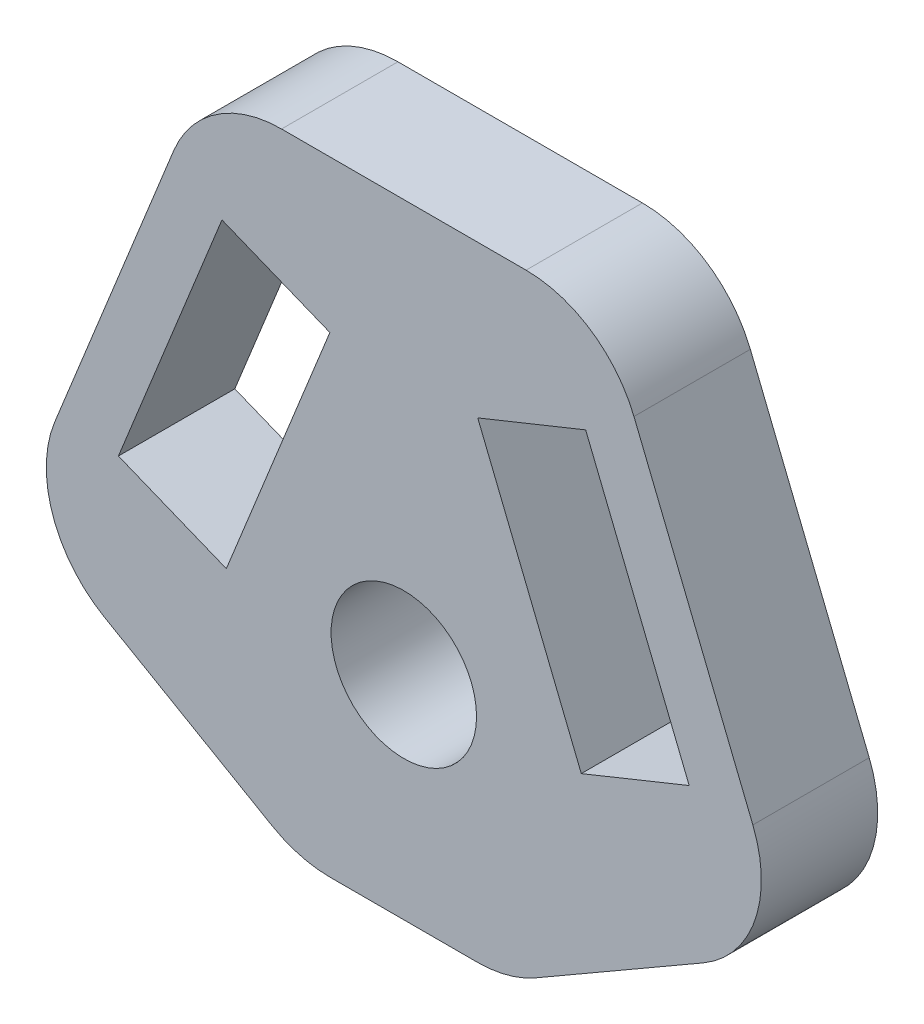
ISO-10303-21;
HEADER;
FILE_DESCRIPTION(('STEP AP214'),'2;1');
FILE_NAME('part.step','',(''),(''),'','','');
FILE_SCHEMA(('AUTOMOTIVE_DESIGN { 1 0 10303 214 1 1 1 1 }'));
ENDSEC;
DATA;
#1=APPLICATION_CONTEXT('core data for automotive mechanical design processes');
#2=APPLICATION_PROTOCOL_DEFINITION('international standard','automotive_design',2000,#1);
#3=PRODUCT_CONTEXT('',#1,'mechanical');
#4=PRODUCT('Part','Part','',(#3));
#5=PRODUCT_RELATED_PRODUCT_CATEGORY('part','',(#4));
#6=PRODUCT_DEFINITION_FORMATION('','',#4);
#7=PRODUCT_DEFINITION_CONTEXT('part definition',#1,'design');
#8=PRODUCT_DEFINITION('design','',#6,#7);
#9=PRODUCT_DEFINITION_SHAPE('','',#8);
#10=(LENGTH_UNIT() NAMED_UNIT(*) SI_UNIT(.MILLI.,.METRE.));
#11=(NAMED_UNIT(*) PLANE_ANGLE_UNIT() SI_UNIT($,.RADIAN.));
#12=(NAMED_UNIT(*) SI_UNIT($,.STERADIAN.) SOLID_ANGLE_UNIT());
#13=UNCERTAINTY_MEASURE_WITH_UNIT(LENGTH_MEASURE(1.E-05),#10,'distance_accuracy_value','');
#14=(GEOMETRIC_REPRESENTATION_CONTEXT(3) GLOBAL_UNCERTAINTY_ASSIGNED_CONTEXT((#13)) GLOBAL_UNIT_ASSIGNED_CONTEXT((#10,
#11,#12)) REPRESENTATION_CONTEXT('',''));
#15=CARTESIAN_POINT('',(0.,0.,0.));
#16=DIRECTION('',(0.,0.,1.));
#17=DIRECTION('',(1.,0.,0.));
#18=AXIS2_PLACEMENT_3D('',#15,#16,#17);
#19=CARTESIAN_POINT('',(0.,0.,4.));
#20=DIRECTION('',(0.,0.,-1.));
#21=DIRECTION('',(-1.,0.,0.));
#22=AXIS2_PLACEMENT_3D('',#19,#20,#21);
#23=PLANE('',#22);
#24=DIRECTION('',(0.927183854566789,0.374606593415907,0.));
#25=VECTOR('',#24,1.);
#26=CARTESIAN_POINT('',(9.80873541826716,1.60097289107058,4.));
#27=LINE('',#26,#25);
#28=CARTESIAN_POINT('',(6.1,0.102546517406955,4.));
#29=VERTEX_POINT('',#28);
#30=CARTESIAN_POINT('',(9.80873541826716,1.60097289107058,4.));
#31=VERTEX_POINT('',#30);
#32=EDGE_CURVE('E232',#29,#31,#27,.T.);
#33=ORIENTED_EDGE('',*,*,#32,.F.);
#34=DIRECTION('',(0.374606593415907,-0.92718385456679,0.));
#35=VECTOR('',#34,1.);
#36=CARTESIAN_POINT('',(6.1,0.102546517406955,4.));
#37=LINE('',#36,#35);
#38=CARTESIAN_POINT('',(2.54123736254889,8.91079313579145,4.));
#39=VERTEX_POINT('',#38);
#40=EDGE_CURVE('E243',#39,#29,#37,.T.);
#41=ORIENTED_EDGE('',*,*,#40,.F.);
#42=DIRECTION('',(-0.92718385456679,-0.374606593415907,0.));
#43=VECTOR('',#42,1.);
#44=CARTESIAN_POINT('',(2.54123736254889,8.91079313579145,4.));
#45=LINE('',#44,#43);
#46=CARTESIAN_POINT('',(6.24997278081605,10.4092195094551,4.));
#47=VERTEX_POINT('',#46);
#48=EDGE_CURVE('E239',#47,#39,#45,.T.);
#49=ORIENTED_EDGE('',*,*,#48,.F.);
#50=DIRECTION('',(-0.374606593415907,0.92718385456679,0.));
#51=VECTOR('',#50,1.);
#52=CARTESIAN_POINT('',(6.24997278081605,10.4092195094551,4.));
#53=LINE('',#52,#51);
#54=EDGE_CURVE('E235',#31,#47,#53,.T.);
#55=ORIENTED_EDGE('',*,*,#54,.F.);
#56=EDGE_LOOP('',(#33,#41,#49,#55));
#57=FACE_BOUND('',#56,.T.);
#58=DIRECTION('',(1.,0.,0.));
#59=VECTOR('',#58,1.);
#60=CARTESIAN_POINT('',(3.6,-7.3,4.));
#61=LINE('',#60,#59);
#62=CARTESIAN_POINT('',(-2.52820323027551,-7.3,4.));
#63=VERTEX_POINT('',#62);
#64=CARTESIAN_POINT('',(2.5282032302755,-7.3,4.));
#65=VERTEX_POINT('',#64);
#66=EDGE_CURVE('E298',#63,#65,#61,.T.);
#67=ORIENTED_EDGE('',*,*,#66,.T.);
#68=CARTESIAN_POINT('',(2.5282032302755,-3.3,4.));
#69=DIRECTION('',(0.,0.,-1.));
#70=DIRECTION('',(-1.,0.,0.));
#71=AXIS2_PLACEMENT_3D('',#68,#69,#70);
#72=CIRCLE('',#71,4.);
#73=CARTESIAN_POINT('',(4.52820323027551,-6.76410161513775,4.));
#74=VERTEX_POINT('',#73);
#75=EDGE_CURVE('E373',#65,#74,#72,.F.);
#76=ORIENTED_EDGE('',*,*,#75,.T.);
#77=DIRECTION('',(0.866025403784438,0.500000000000001,0.));
#78=VECTOR('',#77,1.);
#79=CARTESIAN_POINT('',(13.2994845223857,-1.69999999999999,4.));
#80=LINE('',#79,#78);
#81=CARTESIAN_POINT('',(10.2881869298987,-3.43857347563243,4.));
#82=VERTEX_POINT('',#81);
#83=EDGE_CURVE('E302',#74,#82,#80,.T.);
#84=ORIENTED_EDGE('',*,*,#83,.T.);
#85=CARTESIAN_POINT('',(8.28818692989871,0.0255281395053208,4.));
#86=DIRECTION('',(0.,0.,-1.));
#87=DIRECTION('',(-1.,0.,0.));
#88=AXIS2_PLACEMENT_3D('',#85,#86,#87);
#89=CIRCLE('',#88,4.);
#90=CARTESIAN_POINT('',(11.9969223481659,1.52395451316895,4.));
#91=VERTEX_POINT('',#90);
#92=EDGE_CURVE('E365',#82,#91,#89,.F.);
#93=ORIENTED_EDGE('',*,*,#92,.T.);
#94=DIRECTION('',(-0.374606593415906,0.92718385456679,0.));
#95=VECTOR('',#94,1.);
#96=CARTESIAN_POINT('',(6.9,14.1392800099982,4.));
#97=LINE('',#96,#95);
#98=CARTESIAN_POINT('',(7.91070135089744,11.6377063836618,4.));
#99=VERTEX_POINT('',#98);
#100=EDGE_CURVE('E283',#91,#99,#97,.T.);
#101=ORIENTED_EDGE('',*,*,#100,.T.);
#102=CARTESIAN_POINT('',(4.20196593263028,10.1392800099982,4.));
#103=DIRECTION('',(0.,0.,-1.));
#104=DIRECTION('',(-1.,0.,0.));
#105=AXIS2_PLACEMENT_3D('',#102,#103,#104);
#106=CIRCLE('',#105,4.);
#107=CARTESIAN_POINT('',(4.20196593263027,14.1392800099982,4.));
#108=VERTEX_POINT('',#107);
#109=EDGE_CURVE('E359',#99,#108,#106,.F.);
#110=ORIENTED_EDGE('',*,*,#109,.T.);
#111=DIRECTION('',(-1.,0.,0.));
#112=VECTOR('',#111,1.);
#113=CARTESIAN_POINT('',(-6.9,14.1392800099982,4.));
#114=LINE('',#113,#112);
#115=CARTESIAN_POINT('',(-4.20196593263028,14.1392800099982,4.));
#116=VERTEX_POINT('',#115);
#117=EDGE_CURVE('E287',#108,#116,#114,.T.);
#118=ORIENTED_EDGE('',*,*,#117,.T.);
#119=CARTESIAN_POINT('',(-4.20196593263028,10.1392800099982,4.));
#120=DIRECTION('',(0.,0.,-1.));
#121=DIRECTION('',(-1.,0.,0.));
#122=AXIS2_PLACEMENT_3D('',#119,#120,#121);
#123=CIRCLE('',#122,4.);
#124=CARTESIAN_POINT('',(-7.91070135089744,11.6377063836618,4.));
#125=VERTEX_POINT('',#124);
#126=EDGE_CURVE('E362',#116,#125,#123,.F.);
#127=ORIENTED_EDGE('',*,*,#126,.T.);
#128=DIRECTION('',(-0.374606593415907,-0.92718385456679,0.));
#129=VECTOR('',#128,1.);
#130=CARTESIAN_POINT('',(-6.9,14.1392800099982,4.));
#131=LINE('',#130,#129);
#132=CARTESIAN_POINT('',(-11.9969223481659,1.52395451316895,4.));
#133=VERTEX_POINT('',#132);
#134=EDGE_CURVE('E292',#125,#133,#131,.T.);
#135=ORIENTED_EDGE('',*,*,#134,.T.);
#136=CARTESIAN_POINT('',(-8.28818692989871,0.0255281395053228,4.));
#137=DIRECTION('',(0.,0.,-1.));
#138=DIRECTION('',(-1.,0.,0.));
#139=AXIS2_PLACEMENT_3D('',#136,#137,#138);
#140=CIRCLE('',#139,4.);
#141=CARTESIAN_POINT('',(-10.2881869298987,-3.43857347563243,4.));
#142=VERTEX_POINT('',#141);
#143=EDGE_CURVE('E62',#133,#142,#140,.F.);
#144=ORIENTED_EDGE('',*,*,#143,.T.);
#145=DIRECTION('',(0.866025403784438,-0.500000000000001,0.));
#146=VECTOR('',#145,1.);
#147=CARTESIAN_POINT('',(-13.2994845223857,-1.69999999999999,4.));
#148=LINE('',#147,#146);
#149=CARTESIAN_POINT('',(-4.52820323027551,-6.76410161513775,4.));
#150=VERTEX_POINT('',#149);
#151=EDGE_CURVE('E295',#142,#150,#148,.T.);
#152=ORIENTED_EDGE('',*,*,#151,.T.);
#153=CARTESIAN_POINT('',(-2.5282032302755,-3.3,4.));
#154=DIRECTION('',(0.,0.,-1.));
#155=DIRECTION('',(-1.,0.,0.));
#156=AXIS2_PLACEMENT_3D('',#153,#154,#155);
#157=CIRCLE('',#156,4.);
#158=EDGE_CURVE('E370',#150,#63,#157,.F.);
#159=ORIENTED_EDGE('',*,*,#158,.T.);
#160=EDGE_LOOP('',(#67,#76,#84,#93,#101,#110,#118,#127,#135,#144,#152,#159));
#161=FACE_BOUND('',#160,.T.);
#162=CARTESIAN_POINT('',(0.,0.,4.));
#163=DIRECTION('',(0.,0.,1.));
#164=DIRECTION('',(1.,0.,0.));
#165=AXIS2_PLACEMENT_3D('',#162,#163,#164);
#166=CIRCLE('',#165,2.5);
#167=CARTESIAN_POINT('',(2.5,0.,4.));
#168=VERTEX_POINT('',#167);
#169=EDGE_CURVE('E275',#168,#168,#166,.T.);
#170=ORIENTED_EDGE('',*,*,#169,.F.);
#171=EDGE_LOOP('',(#170));
#172=FACE_BOUND('',#171,.T.);
#173=DIRECTION('',(0.92718385456679,-0.374606593415907,0.));
#174=VECTOR('',#173,1.);
#175=CARTESIAN_POINT('',(-9.80873541826716,1.60097289107058,4.));
#176=LINE('',#175,#174);
#177=CARTESIAN_POINT('',(-9.80873541826716,1.60097289107058,4.));
#178=VERTEX_POINT('',#177);
#179=CARTESIAN_POINT('',(-6.1,0.102546517406955,4.));
#180=VERTEX_POINT('',#179);
#181=EDGE_CURVE('E179',#178,#180,#176,.T.);
#182=ORIENTED_EDGE('',*,*,#181,.F.);
#183=DIRECTION('',(-0.374606593415907,-0.927183854566789,0.));
#184=VECTOR('',#183,1.);
#185=CARTESIAN_POINT('',(-6.24997278081605,10.4092195094551,4.));
#186=LINE('',#185,#184);
#187=CARTESIAN_POINT('',(-6.24997278081605,10.4092195094551,4.));
#188=VERTEX_POINT('',#187);
#189=EDGE_CURVE('E208',#188,#178,#186,.T.);
#190=ORIENTED_EDGE('',*,*,#189,.F.);
#191=DIRECTION('',(-0.92718385456679,0.374606593415907,0.));
#192=VECTOR('',#191,1.);
#193=CARTESIAN_POINT('',(-2.54123736254889,8.91079313579145,4.));
#194=LINE('',#193,#192);
#195=CARTESIAN_POINT('',(-2.54123736254889,8.91079313579145,4.));
#196=VERTEX_POINT('',#195);
#197=EDGE_CURVE('E204',#196,#188,#194,.T.);
#198=ORIENTED_EDGE('',*,*,#197,.F.);
#199=DIRECTION('',(0.374606593415907,0.927183854566789,0.));
#200=VECTOR('',#199,1.);
#201=CARTESIAN_POINT('',(-6.1,0.102546517406955,4.));
#202=LINE('',#201,#200);
#203=EDGE_CURVE('E190',#180,#196,#202,.T.);
#204=ORIENTED_EDGE('',*,*,#203,.F.);
#205=EDGE_LOOP('',(#182,#190,#198,#204));
#206=FACE_BOUND('',#205,.T.);
#207=ADVANCED_FACE('F39',(#57,#161,#172,#206),#23,.F.);
#208=CARTESIAN_POINT('',(0.,0.,0.));
#209=DIRECTION('',(0.,0.,-1.));
#210=DIRECTION('',(-1.,0.,0.));
#211=AXIS2_PLACEMENT_3D('',#208,#209,#210);
#212=PLANE('',#211);
#213=DIRECTION('',(0.866025403784438,0.500000000000001,0.));
#214=VECTOR('',#213,1.);
#215=CARTESIAN_POINT('',(13.2994845223857,-1.69999999999999,0.));
#216=LINE('',#215,#214);
#217=CARTESIAN_POINT('',(4.52820323027551,-6.76410161513775,0.));
#218=VERTEX_POINT('',#217);
#219=CARTESIAN_POINT('',(10.2881869298987,-3.43857347563243,0.));
#220=VERTEX_POINT('',#219);
#221=EDGE_CURVE('E288',#218,#220,#216,.T.);
#222=ORIENTED_EDGE('',*,*,#221,.F.);
#223=CARTESIAN_POINT('',(2.5282032302755,-3.3,0.));
#224=DIRECTION('',(0.,0.,-1.));
#225=DIRECTION('',(-1.,0.,0.));
#226=AXIS2_PLACEMENT_3D('',#223,#224,#225);
#227=CIRCLE('',#226,4.);
#228=CARTESIAN_POINT('',(2.5282032302755,-7.3,0.));
#229=VERTEX_POINT('',#228);
#230=EDGE_CURVE('E349',#218,#229,#227,.T.);
#231=ORIENTED_EDGE('',*,*,#230,.T.);
#232=DIRECTION('',(1.,0.,0.));
#233=VECTOR('',#232,1.);
#234=CARTESIAN_POINT('',(3.6,-7.3,0.));
#235=LINE('',#234,#233);
#236=CARTESIAN_POINT('',(-2.52820323027551,-7.3,0.));
#237=VERTEX_POINT('',#236);
#238=EDGE_CURVE('E321',#237,#229,#235,.T.);
#239=ORIENTED_EDGE('',*,*,#238,.F.);
#240=CARTESIAN_POINT('',(-2.5282032302755,-3.3,0.));
#241=DIRECTION('',(0.,0.,-1.));
#242=DIRECTION('',(-1.,0.,0.));
#243=AXIS2_PLACEMENT_3D('',#240,#241,#242);
#244=CIRCLE('',#243,4.);
#245=CARTESIAN_POINT('',(-4.52820323027551,-6.76410161513775,0.));
#246=VERTEX_POINT('',#245);
#247=EDGE_CURVE('E346',#237,#246,#244,.T.);
#248=ORIENTED_EDGE('',*,*,#247,.T.);
#249=DIRECTION('',(0.866025403784438,-0.500000000000001,0.));
#250=VECTOR('',#249,1.);
#251=CARTESIAN_POINT('',(-13.2994845223857,-1.69999999999999,0.));
#252=LINE('',#251,#250);
#253=CARTESIAN_POINT('',(-10.2881869298987,-3.43857347563243,0.));
#254=VERTEX_POINT('',#253);
#255=EDGE_CURVE('E318',#254,#246,#252,.T.);
#256=ORIENTED_EDGE('',*,*,#255,.F.);
#257=CARTESIAN_POINT('',(-8.28818692989871,0.0255281395053228,0.));
#258=DIRECTION('',(0.,0.,-1.));
#259=DIRECTION('',(-1.,0.,0.));
#260=AXIS2_PLACEMENT_3D('',#257,#258,#259);
#261=CIRCLE('',#260,4.);
#262=CARTESIAN_POINT('',(-11.9969223481659,1.52395451316895,0.));
#263=VERTEX_POINT('',#262);
#264=EDGE_CURVE('E343',#254,#263,#261,.T.);
#265=ORIENTED_EDGE('',*,*,#264,.T.);
#266=DIRECTION('',(-0.374606593415907,-0.92718385456679,0.));
#267=VECTOR('',#266,1.);
#268=CARTESIAN_POINT('',(-6.9,14.1392800099982,0.));
#269=LINE('',#268,#267);
#270=CARTESIAN_POINT('',(-7.91070135089744,11.6377063836618,0.));
#271=VERTEX_POINT('',#270);
#272=EDGE_CURVE('E314',#271,#263,#269,.T.);
#273=ORIENTED_EDGE('',*,*,#272,.F.);
#274=CARTESIAN_POINT('',(-4.20196593263028,10.1392800099982,0.));
#275=DIRECTION('',(0.,0.,-1.));
#276=DIRECTION('',(-1.,0.,0.));
#277=AXIS2_PLACEMENT_3D('',#274,#275,#276);
#278=CIRCLE('',#277,4.);
#279=CARTESIAN_POINT('',(-4.20196593263028,14.1392800099982,0.));
#280=VERTEX_POINT('',#279);
#281=EDGE_CURVE('E337',#271,#280,#278,.T.);
#282=ORIENTED_EDGE('',*,*,#281,.T.);
#283=DIRECTION('',(-1.,0.,0.));
#284=VECTOR('',#283,1.);
#285=CARTESIAN_POINT('',(-6.9,14.1392800099982,0.));
#286=LINE('',#285,#284);
#287=CARTESIAN_POINT('',(4.20196593263027,14.1392800099982,0.));
#288=VERTEX_POINT('',#287);
#289=EDGE_CURVE('E310',#288,#280,#286,.T.);
#290=ORIENTED_EDGE('',*,*,#289,.F.);
#291=CARTESIAN_POINT('',(4.20196593263028,10.1392800099982,0.));
#292=DIRECTION('',(0.,0.,-1.));
#293=DIRECTION('',(-1.,0.,0.));
#294=AXIS2_PLACEMENT_3D('',#291,#292,#293);
#295=CIRCLE('',#294,4.);
#296=CARTESIAN_POINT('',(7.91070135089744,11.6377063836618,0.));
#297=VERTEX_POINT('',#296);
#298=EDGE_CURVE('E334',#288,#297,#295,.T.);
#299=ORIENTED_EDGE('',*,*,#298,.T.);
#300=DIRECTION('',(-0.374606593415906,0.92718385456679,0.));
#301=VECTOR('',#300,1.);
#302=CARTESIAN_POINT('',(6.9,14.1392800099982,0.));
#303=LINE('',#302,#301);
#304=CARTESIAN_POINT('',(11.9969223481659,1.52395451316895,0.));
#305=VERTEX_POINT('',#304);
#306=EDGE_CURVE('E279',#305,#297,#303,.T.);
#307=ORIENTED_EDGE('',*,*,#306,.F.);
#308=CARTESIAN_POINT('',(8.28818692989871,0.0255281395053208,0.));
#309=DIRECTION('',(0.,0.,-1.));
#310=DIRECTION('',(-1.,0.,0.));
#311=AXIS2_PLACEMENT_3D('',#308,#309,#310);
#312=CIRCLE('',#311,4.);
#313=EDGE_CURVE('E340',#305,#220,#312,.T.);
#314=ORIENTED_EDGE('',*,*,#313,.T.);
#315=EDGE_LOOP('',(#222,#231,#239,#248,#256,#265,#273,#282,#290,#299,#307,#314));
#316=FACE_BOUND('',#315,.T.);
#317=CARTESIAN_POINT('',(0.,0.,0.));
#318=DIRECTION('',(0.,0.,1.));
#319=DIRECTION('',(1.,0.,0.));
#320=AXIS2_PLACEMENT_3D('',#317,#318,#319);
#321=CIRCLE('',#320,2.5);
#322=CARTESIAN_POINT('',(2.5,0.,0.));
#323=VERTEX_POINT('',#322);
#324=EDGE_CURVE('E274',#323,#323,#321,.T.);
#325=ORIENTED_EDGE('',*,*,#324,.T.);
#326=EDGE_LOOP('',(#325));
#327=FACE_BOUND('',#326,.T.);
#328=DIRECTION('',(0.374606593415907,-0.92718385456679,0.));
#329=VECTOR('',#328,1.);
#330=CARTESIAN_POINT('',(6.1,0.102546517406955,0.));
#331=LINE('',#330,#329);
#332=CARTESIAN_POINT('',(2.54123736254889,8.91079313579145,0.));
#333=VERTEX_POINT('',#332);
#334=CARTESIAN_POINT('',(6.1,0.102546517406955,0.));
#335=VERTEX_POINT('',#334);
#336=EDGE_CURVE('E236',#333,#335,#331,.T.);
#337=ORIENTED_EDGE('',*,*,#336,.T.);
#338=DIRECTION('',(0.927183854566789,0.374606593415907,0.));
#339=VECTOR('',#338,1.);
#340=CARTESIAN_POINT('',(9.80873541826716,1.60097289107058,0.));
#341=LINE('',#340,#339);
#342=CARTESIAN_POINT('',(9.80873541826716,1.60097289107058,0.));
#343=VERTEX_POINT('',#342);
#344=EDGE_CURVE('E199',#335,#343,#341,.T.);
#345=ORIENTED_EDGE('',*,*,#344,.T.);
#346=DIRECTION('',(-0.374606593415907,0.92718385456679,0.));
#347=VECTOR('',#346,1.);
#348=CARTESIAN_POINT('',(6.24997278081605,10.4092195094551,0.));
#349=LINE('',#348,#347);
#350=CARTESIAN_POINT('',(6.24997278081605,10.4092195094551,0.));
#351=VERTEX_POINT('',#350);
#352=EDGE_CURVE('E250',#343,#351,#349,.T.);
#353=ORIENTED_EDGE('',*,*,#352,.T.);
#354=DIRECTION('',(-0.92718385456679,-0.374606593415907,0.));
#355=VECTOR('',#354,1.);
#356=CARTESIAN_POINT('',(2.54123736254889,8.91079313579145,0.));
#357=LINE('',#356,#355);
#358=EDGE_CURVE('E254',#351,#333,#357,.T.);
#359=ORIENTED_EDGE('',*,*,#358,.T.);
#360=EDGE_LOOP('',(#337,#345,#353,#359));
#361=FACE_BOUND('',#360,.T.);
#362=DIRECTION('',(-0.374606593415907,-0.927183854566789,0.));
#363=VECTOR('',#362,1.);
#364=CARTESIAN_POINT('',(-6.24997278081605,10.4092195094551,0.));
#365=LINE('',#364,#363);
#366=CARTESIAN_POINT('',(-6.24997278081605,10.4092195094551,0.));
#367=VERTEX_POINT('',#366);
#368=CARTESIAN_POINT('',(-9.80873541826716,1.60097289107058,0.));
#369=VERTEX_POINT('',#368);
#370=EDGE_CURVE('E191',#367,#369,#365,.T.);
#371=ORIENTED_EDGE('',*,*,#370,.T.);
#372=DIRECTION('',(0.92718385456679,-0.374606593415907,0.));
#373=VECTOR('',#372,1.);
#374=CARTESIAN_POINT('',(-9.80873541826716,1.60097289107058,0.));
#375=LINE('',#374,#373);
#376=CARTESIAN_POINT('',(-6.1,0.102546517406955,0.));
#377=VERTEX_POINT('',#376);
#378=EDGE_CURVE('E213',#369,#377,#375,.T.);
#379=ORIENTED_EDGE('',*,*,#378,.T.);
#380=DIRECTION('',(0.374606593415907,0.927183854566789,0.));
#381=VECTOR('',#380,1.);
#382=CARTESIAN_POINT('',(-6.1,0.102546517406955,0.));
#383=LINE('',#382,#381);
#384=CARTESIAN_POINT('',(-2.54123736254889,8.91079313579145,0.));
#385=VERTEX_POINT('',#384);
#386=EDGE_CURVE('E197',#377,#385,#383,.T.);
#387=ORIENTED_EDGE('',*,*,#386,.T.);
#388=DIRECTION('',(-0.92718385456679,0.374606593415907,0.));
#389=VECTOR('',#388,1.);
#390=CARTESIAN_POINT('',(-2.54123736254889,8.91079313579145,0.));
#391=LINE('',#390,#389);
#392=EDGE_CURVE('E218',#385,#367,#391,.T.);
#393=ORIENTED_EDGE('',*,*,#392,.T.);
#394=EDGE_LOOP('',(#371,#379,#387,#393));
#395=FACE_BOUND('',#394,.T.);
#396=ADVANCED_FACE('F407',(#316,#327,#361,#395),#212,.T.);
#397=CARTESIAN_POINT('',(6.9,14.1392800099982,4.));
#398=DIRECTION('',(-0.92718385456679,-0.374606593415906,0.));
#399=DIRECTION('',(0.374606593415906,-0.92718385456679,0.));
#400=AXIS2_PLACEMENT_3D('',#397,#398,#399);
#401=PLANE('',#400);
#402=ORIENTED_EDGE('',*,*,#100,.F.);
#403=DIRECTION('',(0.,0.,-1.));
#404=VECTOR('',#403,1.);
#405=CARTESIAN_POINT('',(11.9969223481659,1.52395451316895,4.));
#406=LINE('',#405,#404);
#407=EDGE_CURVE('E392',#91,#305,#406,.T.);
#408=ORIENTED_EDGE('',*,*,#407,.T.);
#409=ORIENTED_EDGE('',*,*,#306,.T.);
#410=DIRECTION('',(0.,0.,-1.));
#411=VECTOR('',#410,1.);
#412=CARTESIAN_POINT('',(7.91070135089744,11.6377063836618,4.));
#413=LINE('',#412,#411);
#414=EDGE_CURVE('E389',#297,#99,#413,.F.);
#415=ORIENTED_EDGE('',*,*,#414,.T.);
#416=EDGE_LOOP('',(#402,#408,#409,#415));
#417=FACE_BOUND('',#416,.T.);
#418=ADVANCED_FACE('F448',(#417),#401,.F.);
#419=CARTESIAN_POINT('',(-6.9,14.1392800099982,4.));
#420=DIRECTION('',(0.,-1.,0.));
#421=DIRECTION('',(1.,0.,0.));
#422=AXIS2_PLACEMENT_3D('',#419,#420,#421);
#423=PLANE('',#422);
#424=ORIENTED_EDGE('',*,*,#289,.T.);
#425=DIRECTION('',(0.,0.,-1.));
#426=VECTOR('',#425,1.);
#427=CARTESIAN_POINT('',(-4.20196593263028,14.1392800099982,4.));
#428=LINE('',#427,#426);
#429=EDGE_CURVE('E11',#280,#116,#428,.F.);
#430=ORIENTED_EDGE('',*,*,#429,.T.);
#431=ORIENTED_EDGE('',*,*,#117,.F.);
#432=DIRECTION('',(0.,0.,-1.));
#433=VECTOR('',#432,1.);
#434=CARTESIAN_POINT('',(4.20196593263028,14.1392800099982,4.));
#435=LINE('',#434,#433);
#436=EDGE_CURVE('E48',#108,#288,#435,.T.);
#437=ORIENTED_EDGE('',*,*,#436,.T.);
#438=EDGE_LOOP('',(#424,#430,#431,#437));
#439=FACE_BOUND('',#438,.T.);
#440=ADVANCED_FACE('F401',(#439),#423,.F.);
#441=CARTESIAN_POINT('',(-6.9,14.1392800099982,4.));
#442=DIRECTION('',(0.92718385456679,-0.374606593415907,0.));
#443=DIRECTION('',(0.374606593415907,0.92718385456679,0.));
#444=AXIS2_PLACEMENT_3D('',#441,#442,#443);
#445=PLANE('',#444);
#446=ORIENTED_EDGE('',*,*,#272,.T.);
#447=DIRECTION('',(0.,0.,-1.));
#448=VECTOR('',#447,1.);
#449=CARTESIAN_POINT('',(-11.9969223481659,1.52395451316895,4.));
#450=LINE('',#449,#448);
#451=EDGE_CURVE('E386',#263,#133,#450,.F.);
#452=ORIENTED_EDGE('',*,*,#451,.T.);
#453=ORIENTED_EDGE('',*,*,#134,.F.);
#454=DIRECTION('',(0.,0.,-1.));
#455=VECTOR('',#454,1.);
#456=CARTESIAN_POINT('',(-7.91070135089744,11.6377063836618,4.));
#457=LINE('',#456,#455);
#458=EDGE_CURVE('E382',#125,#271,#457,.T.);
#459=ORIENTED_EDGE('',*,*,#458,.T.);
#460=EDGE_LOOP('',(#446,#452,#453,#459));
#461=FACE_BOUND('',#460,.T.);
#462=ADVANCED_FACE('F417',(#461),#445,.F.);
#463=CARTESIAN_POINT('',(-13.2994845223857,-1.69999999999999,4.));
#464=DIRECTION('',(0.500000000000001,0.866025403784438,0.));
#465=DIRECTION('',(-0.866025403784438,0.500000000000001,0.));
#466=AXIS2_PLACEMENT_3D('',#463,#464,#465);
#467=PLANE('',#466);
#468=ORIENTED_EDGE('',*,*,#255,.T.);
#469=DIRECTION('',(0.,0.,-1.));
#470=VECTOR('',#469,1.);
#471=CARTESIAN_POINT('',(-4.52820323027551,-6.76410161513775,4.));
#472=LINE('',#471,#470);
#473=EDGE_CURVE('E55',#246,#150,#472,.F.);
#474=ORIENTED_EDGE('',*,*,#473,.T.);
#475=ORIENTED_EDGE('',*,*,#151,.F.);
#476=DIRECTION('',(0.,0.,-1.));
#477=VECTOR('',#476,1.);
#478=CARTESIAN_POINT('',(-10.2881869298987,-3.43857347563243,4.));
#479=LINE('',#478,#477);
#480=EDGE_CURVE('E376',#142,#254,#479,.T.);
#481=ORIENTED_EDGE('',*,*,#480,.T.);
#482=EDGE_LOOP('',(#468,#474,#475,#481));
#483=FACE_BOUND('',#482,.T.);
#484=ADVANCED_FACE('F424',(#483),#467,.F.);
#485=CARTESIAN_POINT('',(3.6,-7.3,4.));
#486=DIRECTION('',(0.,1.,0.));
#487=DIRECTION('',(-1.,0.,0.));
#488=AXIS2_PLACEMENT_3D('',#485,#486,#487);
#489=PLANE('',#488);
#490=ORIENTED_EDGE('',*,*,#238,.T.);
#491=DIRECTION('',(0.,0.,-1.));
#492=VECTOR('',#491,1.);
#493=CARTESIAN_POINT('',(2.5282032302755,-7.3,4.));
#494=LINE('',#493,#492);
#495=EDGE_CURVE('E356',#229,#65,#494,.F.);
#496=ORIENTED_EDGE('',*,*,#495,.T.);
#497=ORIENTED_EDGE('',*,*,#66,.F.);
#498=DIRECTION('',(0.,0.,-1.));
#499=VECTOR('',#498,1.);
#500=CARTESIAN_POINT('',(-2.52820323027551,-7.3,4.));
#501=LINE('',#500,#499);
#502=EDGE_CURVE('E352',#63,#237,#501,.T.);
#503=ORIENTED_EDGE('',*,*,#502,.T.);
#504=EDGE_LOOP('',(#490,#496,#497,#503));
#505=FACE_BOUND('',#504,.T.);
#506=ADVANCED_FACE('F432',(#505),#489,.F.);
#507=CARTESIAN_POINT('',(13.2994845223857,-1.69999999999999,4.));
#508=DIRECTION('',(-0.500000000000001,0.866025403784438,0.));
#509=DIRECTION('',(-0.866025403784438,-0.500000000000001,0.));
#510=AXIS2_PLACEMENT_3D('',#507,#508,#509);
#511=PLANE('',#510);
#512=ORIENTED_EDGE('',*,*,#83,.F.);
#513=DIRECTION('',(0.,0.,-1.));
#514=VECTOR('',#513,1.);
#515=CARTESIAN_POINT('',(4.52820323027551,-6.76410161513775,4.));
#516=LINE('',#515,#514);
#517=EDGE_CURVE('E330',#74,#218,#516,.T.);
#518=ORIENTED_EDGE('',*,*,#517,.T.);
#519=ORIENTED_EDGE('',*,*,#221,.T.);
#520=DIRECTION('',(0.,0.,-1.));
#521=VECTOR('',#520,1.);
#522=CARTESIAN_POINT('',(10.2881869298987,-3.43857347563243,4.));
#523=LINE('',#522,#521);
#524=EDGE_CURVE('E306',#220,#82,#523,.F.);
#525=ORIENTED_EDGE('',*,*,#524,.T.);
#526=EDGE_LOOP('',(#512,#518,#519,#525));
#527=FACE_BOUND('',#526,.T.);
#528=ADVANCED_FACE('F440',(#527),#511,.F.);
#529=CARTESIAN_POINT('',(0.,0.,4.));
#530=DIRECTION('',(0.,0.,-1.));
#531=DIRECTION('',(-1.,0.,0.));
#532=AXIS2_PLACEMENT_3D('',#529,#530,#531);
#533=CYLINDRICAL_SURFACE('',#532,2.5);
#534=ORIENTED_EDGE('',*,*,#169,.T.);
#535=EDGE_LOOP('',(#534));
#536=FACE_BOUND('',#535,.T.);
#537=ORIENTED_EDGE('',*,*,#324,.F.);
#538=EDGE_LOOP('',(#537));
#539=FACE_BOUND('',#538,.T.);
#540=ADVANCED_FACE('F463',(#536,#539),#533,.F.);
#541=CARTESIAN_POINT('',(9.80873541826716,1.60097289107058,4.));
#542=DIRECTION('',(-0.374606593415907,0.92718385456679,0.));
#543=DIRECTION('',(-0.92718385456679,-0.374606593415907,0.));
#544=AXIS2_PLACEMENT_3D('',#541,#542,#543);
#545=PLANE('',#544);
#546=ORIENTED_EDGE('',*,*,#344,.F.);
#547=DIRECTION('',(0.,0.,-1.));
#548=VECTOR('',#547,1.);
#549=CARTESIAN_POINT('',(6.1,0.102546517406955,4.));
#550=LINE('',#549,#548);
#551=EDGE_CURVE('E246',#29,#335,#550,.T.);
#552=ORIENTED_EDGE('',*,*,#551,.F.);
#553=ORIENTED_EDGE('',*,*,#32,.T.);
#554=DIRECTION('',(0.,0.,-1.));
#555=VECTOR('',#554,1.);
#556=CARTESIAN_POINT('',(9.80873541826716,1.60097289107058,4.));
#557=LINE('',#556,#555);
#558=EDGE_CURVE('E270',#31,#343,#557,.T.);
#559=ORIENTED_EDGE('',*,*,#558,.T.);
#560=EDGE_LOOP('',(#546,#552,#553,#559));
#561=FACE_BOUND('',#560,.T.);
#562=ADVANCED_FACE('F575',(#561),#545,.T.);
#563=CARTESIAN_POINT('',(6.24997278081605,10.4092195094551,4.));
#564=DIRECTION('',(-0.92718385456679,-0.374606593415907,0.));
#565=DIRECTION('',(0.374606593415907,-0.92718385456679,0.));
#566=AXIS2_PLACEMENT_3D('',#563,#564,#565);
#567=PLANE('',#566);
#568=ORIENTED_EDGE('',*,*,#352,.F.);
#569=ORIENTED_EDGE('',*,*,#558,.F.);
#570=ORIENTED_EDGE('',*,*,#54,.T.);
#571=DIRECTION('',(0.,0.,-1.));
#572=VECTOR('',#571,1.);
#573=CARTESIAN_POINT('',(6.24997278081605,10.4092195094551,4.));
#574=LINE('',#573,#572);
#575=EDGE_CURVE('E267',#47,#351,#574,.T.);
#576=ORIENTED_EDGE('',*,*,#575,.T.);
#577=EDGE_LOOP('',(#568,#569,#570,#576));
#578=FACE_BOUND('',#577,.T.);
#579=ADVANCED_FACE('F566',(#578),#567,.T.);
#580=CARTESIAN_POINT('',(2.54123736254889,8.91079313579145,4.));
#581=DIRECTION('',(0.374606593415907,-0.92718385456679,0.));
#582=DIRECTION('',(0.92718385456679,0.374606593415907,0.));
#583=AXIS2_PLACEMENT_3D('',#580,#581,#582);
#584=PLANE('',#583);
#585=ORIENTED_EDGE('',*,*,#358,.F.);
#586=ORIENTED_EDGE('',*,*,#575,.F.);
#587=ORIENTED_EDGE('',*,*,#48,.T.);
#588=DIRECTION('',(0.,0.,-1.));
#589=VECTOR('',#588,1.);
#590=CARTESIAN_POINT('',(2.54123736254889,8.91079313579145,4.));
#591=LINE('',#590,#589);
#592=EDGE_CURVE('E264',#39,#333,#591,.T.);
#593=ORIENTED_EDGE('',*,*,#592,.T.);
#594=EDGE_LOOP('',(#585,#586,#587,#593));
#595=FACE_BOUND('',#594,.T.);
#596=ADVANCED_FACE('F557',(#595),#584,.T.);
#597=CARTESIAN_POINT('',(6.1,0.102546517406955,4.));
#598=DIRECTION('',(0.92718385456679,0.374606593415907,0.));
#599=DIRECTION('',(-0.374606593415907,0.92718385456679,0.));
#600=AXIS2_PLACEMENT_3D('',#597,#598,#599);
#601=PLANE('',#600);
#602=ORIENTED_EDGE('',*,*,#336,.F.);
#603=ORIENTED_EDGE('',*,*,#592,.F.);
#604=ORIENTED_EDGE('',*,*,#40,.T.);
#605=ORIENTED_EDGE('',*,*,#551,.T.);
#606=EDGE_LOOP('',(#602,#603,#604,#605));
#607=FACE_BOUND('',#606,.T.);
#608=ADVANCED_FACE('F549',(#607),#601,.T.);
#609=CARTESIAN_POINT('',(-9.80873541826716,1.60097289107058,4.));
#610=DIRECTION('',(0.374606593415907,0.92718385456679,0.));
#611=DIRECTION('',(-0.92718385456679,0.374606593415907,0.));
#612=AXIS2_PLACEMENT_3D('',#609,#610,#611);
#613=PLANE('',#612);
#614=ORIENTED_EDGE('',*,*,#378,.F.);
#615=DIRECTION('',(0.,0.,-1.));
#616=VECTOR('',#615,1.);
#617=CARTESIAN_POINT('',(-9.80873541826716,1.60097289107058,4.));
#618=LINE('',#617,#616);
#619=EDGE_CURVE('E185',#178,#369,#618,.T.);
#620=ORIENTED_EDGE('',*,*,#619,.F.);
#621=ORIENTED_EDGE('',*,*,#181,.T.);
#622=DIRECTION('',(0.,0.,-1.));
#623=VECTOR('',#622,1.);
#624=CARTESIAN_POINT('',(-6.1,0.102546517406955,4.));
#625=LINE('',#624,#623);
#626=EDGE_CURVE('E182',#180,#377,#625,.T.);
#627=ORIENTED_EDGE('',*,*,#626,.T.);
#628=EDGE_LOOP('',(#614,#620,#621,#627));
#629=FACE_BOUND('',#628,.T.);
#630=ADVANCED_FACE('F181',(#629),#613,.T.);
#631=CARTESIAN_POINT('',(-6.1,0.102546517406955,4.));
#632=DIRECTION('',(-0.92718385456679,0.374606593415907,0.));
#633=DIRECTION('',(-0.374606593415907,-0.92718385456679,0.));
#634=AXIS2_PLACEMENT_3D('',#631,#632,#633);
#635=PLANE('',#634);
#636=ORIENTED_EDGE('',*,*,#386,.F.);
#637=ORIENTED_EDGE('',*,*,#626,.F.);
#638=ORIENTED_EDGE('',*,*,#203,.T.);
#639=DIRECTION('',(0.,0.,-1.));
#640=VECTOR('',#639,1.);
#641=CARTESIAN_POINT('',(-2.54123736254889,8.91079313579145,4.));
#642=LINE('',#641,#640);
#643=EDGE_CURVE('E200',#196,#385,#642,.T.);
#644=ORIENTED_EDGE('',*,*,#643,.T.);
#645=EDGE_LOOP('',(#636,#637,#638,#644));
#646=FACE_BOUND('',#645,.T.);
#647=ADVANCED_FACE('F194',(#646),#635,.T.);
#648=CARTESIAN_POINT('',(-2.54123736254889,8.91079313579145,4.));
#649=DIRECTION('',(-0.374606593415907,-0.92718385456679,0.));
#650=DIRECTION('',(0.92718385456679,-0.374606593415907,0.));
#651=AXIS2_PLACEMENT_3D('',#648,#649,#650);
#652=PLANE('',#651);
#653=ORIENTED_EDGE('',*,*,#392,.F.);
#654=ORIENTED_EDGE('',*,*,#643,.F.);
#655=ORIENTED_EDGE('',*,*,#197,.T.);
#656=DIRECTION('',(0.,0.,-1.));
#657=VECTOR('',#656,1.);
#658=CARTESIAN_POINT('',(-6.24997278081605,10.4092195094551,4.));
#659=LINE('',#658,#657);
#660=EDGE_CURVE('E227',#188,#367,#659,.T.);
#661=ORIENTED_EDGE('',*,*,#660,.T.);
#662=EDGE_LOOP('',(#653,#654,#655,#661));
#663=FACE_BOUND('',#662,.T.);
#664=ADVANCED_FACE('F525',(#663),#652,.T.);
#665=CARTESIAN_POINT('',(-6.24997278081605,10.4092195094551,4.));
#666=DIRECTION('',(0.92718385456679,-0.374606593415907,0.));
#667=DIRECTION('',(0.374606593415907,0.92718385456679,0.));
#668=AXIS2_PLACEMENT_3D('',#665,#666,#667);
#669=PLANE('',#668);
#670=ORIENTED_EDGE('',*,*,#370,.F.);
#671=ORIENTED_EDGE('',*,*,#660,.F.);
#672=ORIENTED_EDGE('',*,*,#189,.T.);
#673=ORIENTED_EDGE('',*,*,#619,.T.);
#674=EDGE_LOOP('',(#670,#671,#672,#673));
#675=FACE_BOUND('',#674,.T.);
#676=ADVANCED_FACE('F480',(#675),#669,.T.);
#677=CARTESIAN_POINT('',(2.5282032302755,-3.3,4.));
#678=DIRECTION('',(0.,0.,-1.));
#679=DIRECTION('',(-1.,0.,0.));
#680=AXIS2_PLACEMENT_3D('',#677,#678,#679);
#681=CYLINDRICAL_SURFACE('',#680,4.);
#682=ORIENTED_EDGE('',*,*,#75,.F.);
#683=ORIENTED_EDGE('',*,*,#495,.F.);
#684=ORIENTED_EDGE('',*,*,#230,.F.);
#685=ORIENTED_EDGE('',*,*,#517,.F.);
#686=EDGE_LOOP('',(#682,#683,#684,#685));
#687=FACE_BOUND('',#686,.T.);
#688=ADVANCED_FACE('F438',(#687),#681,.T.);
#689=CARTESIAN_POINT('',(-2.5282032302755,-3.3,4.));
#690=DIRECTION('',(0.,0.,-1.));
#691=DIRECTION('',(-1.,0.,0.));
#692=AXIS2_PLACEMENT_3D('',#689,#690,#691);
#693=CYLINDRICAL_SURFACE('',#692,4.);
#694=ORIENTED_EDGE('',*,*,#158,.F.);
#695=ORIENTED_EDGE('',*,*,#473,.F.);
#696=ORIENTED_EDGE('',*,*,#247,.F.);
#697=ORIENTED_EDGE('',*,*,#502,.F.);
#698=EDGE_LOOP('',(#694,#695,#696,#697));
#699=FACE_BOUND('',#698,.T.);
#700=ADVANCED_FACE('F429',(#699),#693,.T.);
#701=CARTESIAN_POINT('',(-8.28818692989871,0.0255281395053228,4.));
#702=DIRECTION('',(0.,0.,-1.));
#703=DIRECTION('',(-1.,0.,0.));
#704=AXIS2_PLACEMENT_3D('',#701,#702,#703);
#705=CYLINDRICAL_SURFACE('',#704,4.);
#706=ORIENTED_EDGE('',*,*,#143,.F.);
#707=ORIENTED_EDGE('',*,*,#451,.F.);
#708=ORIENTED_EDGE('',*,*,#264,.F.);
#709=ORIENTED_EDGE('',*,*,#480,.F.);
#710=EDGE_LOOP('',(#706,#707,#708,#709));
#711=FACE_BOUND('',#710,.T.);
#712=ADVANCED_FACE('F422',(#711),#705,.T.);
#713=CARTESIAN_POINT('',(8.28818692989871,0.0255281395053208,4.));
#714=DIRECTION('',(0.,0.,-1.));
#715=DIRECTION('',(-1.,0.,0.));
#716=AXIS2_PLACEMENT_3D('',#713,#714,#715);
#717=CYLINDRICAL_SURFACE('',#716,4.);
#718=ORIENTED_EDGE('',*,*,#92,.F.);
#719=ORIENTED_EDGE('',*,*,#524,.F.);
#720=ORIENTED_EDGE('',*,*,#313,.F.);
#721=ORIENTED_EDGE('',*,*,#407,.F.);
#722=EDGE_LOOP('',(#718,#719,#720,#721));
#723=FACE_BOUND('',#722,.T.);
#724=ADVANCED_FACE('F445',(#723),#717,.T.);
#725=CARTESIAN_POINT('',(-4.20196593263028,10.1392800099982,4.));
#726=DIRECTION('',(0.,0.,-1.));
#727=DIRECTION('',(-1.,0.,0.));
#728=AXIS2_PLACEMENT_3D('',#725,#726,#727);
#729=CYLINDRICAL_SURFACE('',#728,4.);
#730=ORIENTED_EDGE('',*,*,#126,.F.);
#731=ORIENTED_EDGE('',*,*,#429,.F.);
#732=ORIENTED_EDGE('',*,*,#281,.F.);
#733=ORIENTED_EDGE('',*,*,#458,.F.);
#734=EDGE_LOOP('',(#730,#731,#732,#733));
#735=FACE_BOUND('',#734,.T.);
#736=ADVANCED_FACE('F414',(#735),#729,.T.);
#737=CARTESIAN_POINT('',(4.20196593263028,10.1392800099982,4.));
#738=DIRECTION('',(0.,0.,-1.));
#739=DIRECTION('',(-1.,0.,0.));
#740=AXIS2_PLACEMENT_3D('',#737,#738,#739);
#741=CYLINDRICAL_SURFACE('',#740,4.);
#742=ORIENTED_EDGE('',*,*,#109,.F.);
#743=ORIENTED_EDGE('',*,*,#414,.F.);
#744=ORIENTED_EDGE('',*,*,#298,.F.);
#745=ORIENTED_EDGE('',*,*,#436,.F.);
#746=EDGE_LOOP('',(#742,#743,#744,#745));
#747=FACE_BOUND('',#746,.T.);
#748=ADVANCED_FACE('F41',(#747),#741,.T.);
#749=CLOSED_SHELL('',(#207,#396,#418,#440,#462,#484,#506,#528,#540,#562,#579,#596,#608,#630,
#647,#664,#676,#688,#700,#712,#724,#736,#748));
#750=MANIFOLD_SOLID_BREP('B2',#749);
#751=ADVANCED_BREP_SHAPE_REPRESENTATION('',(#18,#750),#14);
#752=SHAPE_DEFINITION_REPRESENTATION(#9,#751);
ENDSEC;
END-ISO-10303-21;
